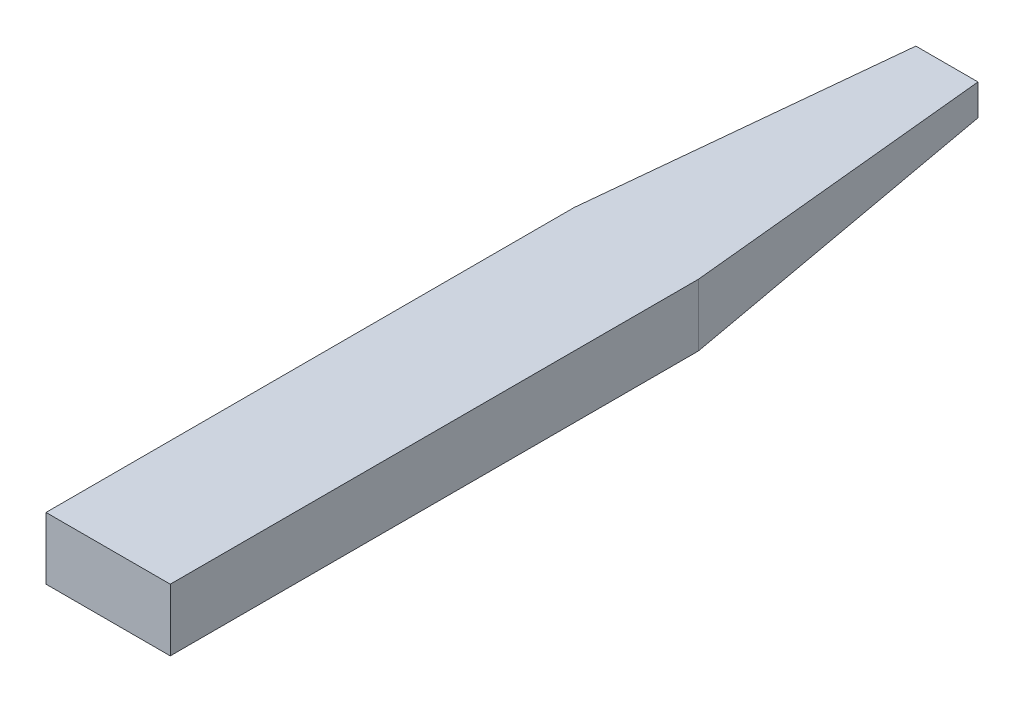
ISO-10303-21;
HEADER;
FILE_DESCRIPTION(('STEP AP214'),'2;1');
FILE_NAME('part.step','',(''),(''),'','','');
FILE_SCHEMA(('AUTOMOTIVE_DESIGN { 1 0 10303 214 1 1 1 1 }'));
ENDSEC;
DATA;
#1=APPLICATION_CONTEXT('core data for automotive mechanical design processes');
#2=APPLICATION_PROTOCOL_DEFINITION('international standard','automotive_design',2000,#1);
#3=PRODUCT_CONTEXT('',#1,'mechanical');
#4=PRODUCT('Part','Part','',(#3));
#5=PRODUCT_RELATED_PRODUCT_CATEGORY('part','',(#4));
#6=PRODUCT_DEFINITION_FORMATION('','',#4);
#7=PRODUCT_DEFINITION_CONTEXT('part definition',#1,'design');
#8=PRODUCT_DEFINITION('design','',#6,#7);
#9=PRODUCT_DEFINITION_SHAPE('','',#8);
#10=(LENGTH_UNIT() NAMED_UNIT(*) SI_UNIT(.MILLI.,.METRE.));
#11=(NAMED_UNIT(*) PLANE_ANGLE_UNIT() SI_UNIT($,.RADIAN.));
#12=(NAMED_UNIT(*) SI_UNIT($,.STERADIAN.) SOLID_ANGLE_UNIT());
#13=UNCERTAINTY_MEASURE_WITH_UNIT(LENGTH_MEASURE(1.E-05),#10,'distance_accuracy_value','');
#14=(GEOMETRIC_REPRESENTATION_CONTEXT(3) GLOBAL_UNCERTAINTY_ASSIGNED_CONTEXT((#13)) GLOBAL_UNIT_ASSIGNED_CONTEXT((#10,
#11,#12)) REPRESENTATION_CONTEXT('',''));
#15=CARTESIAN_POINT('',(0.,0.,0.));
#16=DIRECTION('',(0.,0.,1.));
#17=DIRECTION('',(1.,0.,0.));
#18=AXIS2_PLACEMENT_3D('',#15,#16,#17);
#19=CARTESIAN_POINT('',(0.,0.,431.8));
#20=DIRECTION('',(1.,0.,0.));
#21=DIRECTION('',(0.,0.,-1.));
#22=AXIS2_PLACEMENT_3D('',#19,#20,#21);
#23=PLANE('',#22);
#24=CARTESIAN_POINT('',(0.,50.8,0.));
#25=DIRECTION('',(0.,-1.,0.));
#26=VECTOR('',#25,1.);
#27=LINE('',#24,#26);
#28=CARTESIAN_POINT('',(0.,50.8,0.));
#29=VERTEX_POINT('',#28);
#30=CARTESIAN_POINT('',(0.,0.,0.));
#31=VERTEX_POINT('',#30);
#32=EDGE_CURVE('E109',#29,#31,#27,.T.);
#33=ORIENTED_EDGE('',*,*,#32,.T.);
#34=DIRECTION('',(0.,0.,-1.));
#35=VECTOR('',#34,1.);
#36=CARTESIAN_POINT('',(0.,0.,431.8));
#37=LINE('',#36,#35);
#38=CARTESIAN_POINT('',(0.,0.,431.8));
#39=VERTEX_POINT('',#38);
#40=EDGE_CURVE('E12',#39,#31,#37,.T.);
#41=ORIENTED_EDGE('',*,*,#40,.F.);
#42=DIRECTION('',(0.,-1.,0.));
#43=VECTOR('',#42,1.);
#44=CARTESIAN_POINT('',(0.,0.,431.8));
#45=LINE('',#44,#43);
#46=CARTESIAN_POINT('',(0.,50.8,431.8));
#47=VERTEX_POINT('',#46);
#48=EDGE_CURVE('E197',#47,#39,#45,.T.);
#49=ORIENTED_EDGE('',*,*,#48,.F.);
#50=DIRECTION('',(0.,0.,-1.));
#51=VECTOR('',#50,1.);
#52=CARTESIAN_POINT('',(0.,50.8,431.8));
#53=LINE('',#52,#51);
#54=EDGE_CURVE('E139',#47,#29,#53,.T.);
#55=ORIENTED_EDGE('',*,*,#54,.T.);
#56=EDGE_LOOP('',(#33,#41,#49,#55));
#57=FACE_BOUND('',#56,.T.);
#58=ADVANCED_FACE('F51',(#57),#23,.F.);
#59=CARTESIAN_POINT('',(0.,0.,431.8));
#60=DIRECTION('',(0.,1.,0.));
#61=DIRECTION('',(0.,0.,1.));
#62=AXIS2_PLACEMENT_3D('',#59,#60,#61);
#63=PLANE('',#62);
#64=CARTESIAN_POINT('',(0.,0.,0.));
#65=DIRECTION('',(1.,0.,0.));
#66=VECTOR('',#65,1.);
#67=LINE('',#64,#66);
#68=CARTESIAN_POINT('',(101.6,0.,0.));
#69=VERTEX_POINT('',#68);
#70=EDGE_CURVE('E121',#31,#69,#67,.T.);
#71=ORIENTED_EDGE('',*,*,#70,.T.);
#72=DIRECTION('',(0.,0.,-1.));
#73=VECTOR('',#72,1.);
#74=CARTESIAN_POINT('',(101.6,0.,431.8));
#75=LINE('',#74,#73);
#76=CARTESIAN_POINT('',(101.6,0.,431.8));
#77=VERTEX_POINT('',#76);
#78=EDGE_CURVE('E63',#77,#69,#75,.T.);
#79=ORIENTED_EDGE('',*,*,#78,.F.);
#80=DIRECTION('',(1.,0.,0.));
#81=VECTOR('',#80,1.);
#82=CARTESIAN_POINT('',(0.,0.,431.8));
#83=LINE('',#82,#81);
#84=EDGE_CURVE('E134',#39,#77,#83,.T.);
#85=ORIENTED_EDGE('',*,*,#84,.F.);
#86=ORIENTED_EDGE('',*,*,#40,.T.);
#87=EDGE_LOOP('',(#71,#79,#85,#86));
#88=FACE_BOUND('',#87,.T.);
#89=ADVANCED_FACE('F133',(#88),#63,.F.);
#90=CARTESIAN_POINT('',(101.6,0.,431.8));
#91=DIRECTION('',(-1.,0.,0.));
#92=DIRECTION('',(0.,0.,1.));
#93=AXIS2_PLACEMENT_3D('',#90,#91,#92);
#94=PLANE('',#93);
#95=CARTESIAN_POINT('',(101.6,0.,0.));
#96=DIRECTION('',(0.,1.,0.));
#97=VECTOR('',#96,1.);
#98=LINE('',#95,#97);
#99=CARTESIAN_POINT('',(101.6,50.8,0.));
#100=VERTEX_POINT('',#99);
#101=EDGE_CURVE('E130',#69,#100,#98,.T.);
#102=ORIENTED_EDGE('',*,*,#101,.T.);
#103=DIRECTION('',(0.,0.,-1.));
#104=VECTOR('',#103,1.);
#105=CARTESIAN_POINT('',(101.6,50.8,431.8));
#106=LINE('',#105,#104);
#107=CARTESIAN_POINT('',(101.6,50.8,431.8));
#108=VERTEX_POINT('',#107);
#109=EDGE_CURVE('E153',#108,#100,#106,.T.);
#110=ORIENTED_EDGE('',*,*,#109,.F.);
#111=DIRECTION('',(0.,1.,0.));
#112=VECTOR('',#111,1.);
#113=CARTESIAN_POINT('',(101.6,0.,431.8));
#114=LINE('',#113,#112);
#115=EDGE_CURVE('E194',#77,#108,#114,.T.);
#116=ORIENTED_EDGE('',*,*,#115,.F.);
#117=ORIENTED_EDGE('',*,*,#78,.T.);
#118=EDGE_LOOP('',(#102,#110,#116,#117));
#119=FACE_BOUND('',#118,.T.);
#120=ADVANCED_FACE('F168',(#119),#94,.F.);
#121=CARTESIAN_POINT('',(0.,50.8,431.8));
#122=DIRECTION('',(0.,-1.,0.));
#123=DIRECTION('',(0.,0.,-1.));
#124=AXIS2_PLACEMENT_3D('',#121,#122,#123);
#125=PLANE('',#124);
#126=ORIENTED_EDGE('',*,*,#109,.T.);
#127=DIRECTION('',(-0.0995037190210193,0.,-0.995037190209987));
#128=VECTOR('',#127,1.);
#129=CARTESIAN_POINT('',(101.6,50.8,0.));
#130=LINE('',#129,#128);
#131=CARTESIAN_POINT('',(76.1999999999947,50.8,-254.000000000001));
#132=VERTEX_POINT('',#131);
#133=EDGE_CURVE('E116',#100,#132,#130,.T.);
#134=ORIENTED_EDGE('',*,*,#133,.T.);
#135=DIRECTION('',(1.,0.,0.));
#136=VECTOR('',#135,1.);
#137=CARTESIAN_POINT('',(76.1999999999947,50.8,-254.000000000001));
#138=LINE('',#137,#136);
#139=CARTESIAN_POINT('',(25.3999999999947,50.8,-254.));
#140=VERTEX_POINT('',#139);
#141=EDGE_CURVE('E237',#140,#132,#138,.T.);
#142=ORIENTED_EDGE('',*,*,#141,.F.);
#143=DIRECTION('',(0.0995037190209782,0.,-0.995037190209991));
#144=VECTOR('',#143,1.);
#145=CARTESIAN_POINT('',(0.,50.8,0.));
#146=LINE('',#145,#144);
#147=EDGE_CURVE('E117',#29,#140,#146,.T.);
#148=ORIENTED_EDGE('',*,*,#147,.F.);
#149=ORIENTED_EDGE('',*,*,#54,.F.);
#150=DIRECTION('',(-1.,0.,0.));
#151=VECTOR('',#150,1.);
#152=CARTESIAN_POINT('',(0.,50.8,431.8));
#153=LINE('',#152,#151);
#154=EDGE_CURVE('E71',#108,#47,#153,.T.);
#155=ORIENTED_EDGE('',*,*,#154,.F.);
#156=EDGE_LOOP('',(#126,#134,#142,#148,#149,#155));
#157=FACE_BOUND('',#156,.T.);
#158=ADVANCED_FACE('F176',(#157),#125,.F.);
#159=CARTESIAN_POINT('',(0.,0.,431.8));
#160=DIRECTION('',(0.,0.,-1.));
#161=DIRECTION('',(-1.,0.,0.));
#162=AXIS2_PLACEMENT_3D('',#159,#160,#161);
#163=PLANE('',#162);
#164=ORIENTED_EDGE('',*,*,#48,.T.);
#165=ORIENTED_EDGE('',*,*,#84,.T.);
#166=ORIENTED_EDGE('',*,*,#115,.T.);
#167=ORIENTED_EDGE('',*,*,#154,.T.);
#168=EDGE_LOOP('',(#164,#165,#166,#167));
#169=FACE_BOUND('',#168,.T.);
#170=ADVANCED_FACE('F214',(#169),#163,.F.);
#171=CARTESIAN_POINT('',(-1.94289029309402E-12,0.,-254.));
#172=DIRECTION('',(0.,0.,1.));
#173=DIRECTION('',(1.,0.,0.));
#174=AXIS2_PLACEMENT_3D('',#171,#172,#173);
#175=PLANE('',#174);
#176=DIRECTION('',(0.,-1.,0.));
#177=VECTOR('',#176,1.);
#178=CARTESIAN_POINT('',(76.1999999999947,25.4,-254.000000000001));
#179=LINE('',#178,#177);
#180=CARTESIAN_POINT('',(76.1999999999947,25.4,-254.000000000001));
#181=VERTEX_POINT('',#180);
#182=EDGE_CURVE('E243',#132,#181,#179,.T.);
#183=ORIENTED_EDGE('',*,*,#182,.T.);
#184=DIRECTION('',(-1.,0.,0.));
#185=VECTOR('',#184,1.);
#186=CARTESIAN_POINT('',(76.1999999999947,25.4,-254.000000000001));
#187=LINE('',#186,#185);
#188=CARTESIAN_POINT('',(25.3999999999947,25.4,-254.));
#189=VERTEX_POINT('',#188);
#190=EDGE_CURVE('E140',#181,#189,#187,.T.);
#191=ORIENTED_EDGE('',*,*,#190,.T.);
#192=DIRECTION('',(0.,1.,0.));
#193=VECTOR('',#192,1.);
#194=CARTESIAN_POINT('',(25.3999999999947,25.4,-254.));
#195=LINE('',#194,#193);
#196=EDGE_CURVE('E112',#189,#140,#195,.T.);
#197=ORIENTED_EDGE('',*,*,#196,.T.);
#198=ORIENTED_EDGE('',*,*,#141,.T.);
#199=EDGE_LOOP('',(#183,#191,#197,#198));
#200=FACE_BOUND('',#199,.T.);
#201=ADVANCED_FACE('F205',(#200),#175,.F.);
#202=CARTESIAN_POINT('',(0.,0.,0.));
#203=DIRECTION('',(0.995037190209991,0.,0.0995037190209782));
#204=DIRECTION('',(0.0995037190209782,0.,-0.995037190209991));
#205=AXIS2_PLACEMENT_3D('',#202,#203,#204);
#206=PLANE('',#205);
#207=ORIENTED_EDGE('',*,*,#147,.T.);
#208=ORIENTED_EDGE('',*,*,#196,.F.);
#209=DIRECTION('',(0.0990147542976468,0.0990147542976676,-0.990147542976676));
#210=VECTOR('',#209,1.);
#211=CARTESIAN_POINT('',(0.,0.,0.));
#212=LINE('',#211,#210);
#213=EDGE_CURVE('E104',#31,#189,#212,.T.);
#214=ORIENTED_EDGE('',*,*,#213,.F.);
#215=ORIENTED_EDGE('',*,*,#32,.F.);
#216=EDGE_LOOP('',(#207,#208,#214,#215));
#217=FACE_BOUND('',#216,.T.);
#218=ADVANCED_FACE('F107',(#217),#206,.F.);
#219=CARTESIAN_POINT('',(0.,0.,0.));
#220=DIRECTION('',(0.,0.995037190209989,0.0995037190209989));
#221=DIRECTION('',(0.,-0.0995037190209989,0.995037190209989));
#222=AXIS2_PLACEMENT_3D('',#219,#220,#221);
#223=PLANE('',#222);
#224=ORIENTED_EDGE('',*,*,#213,.T.);
#225=ORIENTED_EDGE('',*,*,#190,.F.);
#226=DIRECTION('',(-0.0990147542976878,0.099014754297667,-0.990147542976672));
#227=VECTOR('',#226,1.);
#228=CARTESIAN_POINT('',(101.6,0.,0.));
#229=LINE('',#228,#227);
#230=EDGE_CURVE('E124',#69,#181,#229,.T.);
#231=ORIENTED_EDGE('',*,*,#230,.F.);
#232=ORIENTED_EDGE('',*,*,#70,.F.);
#233=EDGE_LOOP('',(#224,#225,#231,#232));
#234=FACE_BOUND('',#233,.T.);
#235=ADVANCED_FACE('F123',(#234),#223,.F.);
#236=CARTESIAN_POINT('',(100.59405940594,0.,-10.0594059405961));
#237=DIRECTION('',(-0.995037190209987,0.,0.0995037190210194));
#238=DIRECTION('',(0.0995037190210194,0.,0.995037190209987));
#239=AXIS2_PLACEMENT_3D('',#236,#237,#238);
#240=PLANE('',#239);
#241=ORIENTED_EDGE('',*,*,#230,.T.);
#242=ORIENTED_EDGE('',*,*,#182,.F.);
#243=ORIENTED_EDGE('',*,*,#133,.F.);
#244=ORIENTED_EDGE('',*,*,#101,.F.);
#245=EDGE_LOOP('',(#241,#242,#243,#244));
#246=FACE_BOUND('',#245,.T.);
#247=ADVANCED_FACE('F216',(#246),#240,.F.);
#248=CLOSED_SHELL('',(#58,#89,#120,#158,#170,#201,#218,#235,#247));
#249=MANIFOLD_SOLID_BREP('B2',#248);
#250=ADVANCED_BREP_SHAPE_REPRESENTATION('',(#18,#249),#14);
#251=SHAPE_DEFINITION_REPRESENTATION(#9,#250);
ENDSEC;
END-ISO-10303-21;
